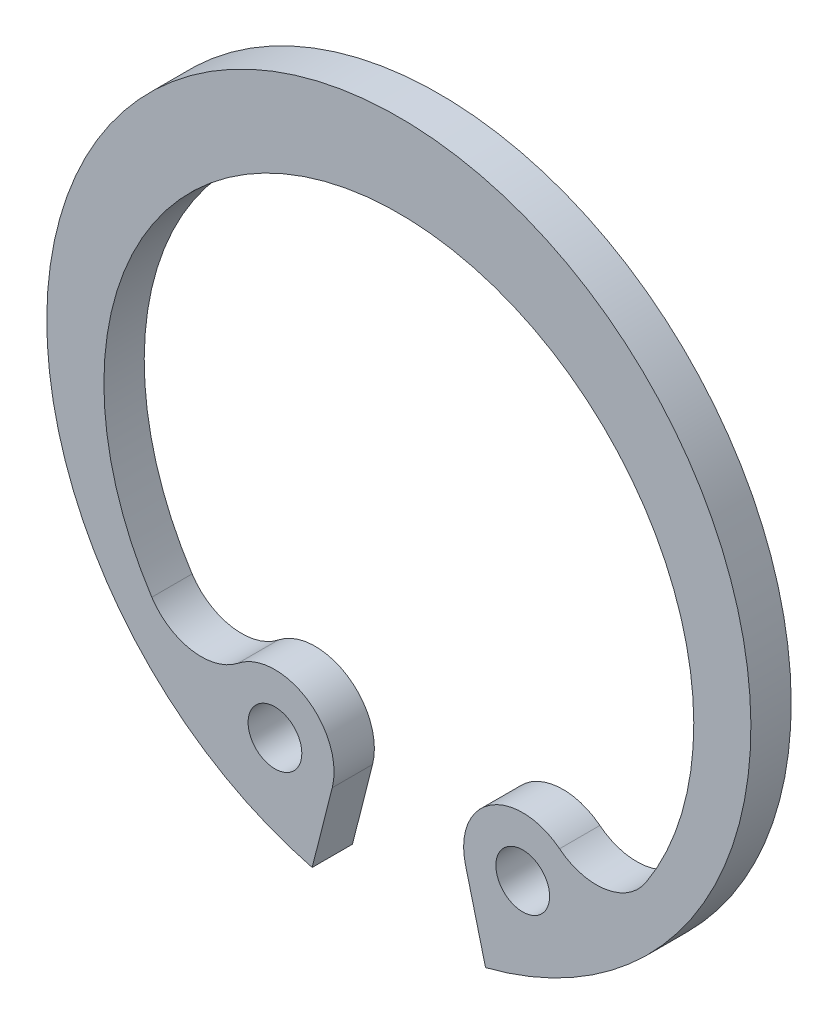
ISO-10303-21;
HEADER;
FILE_DESCRIPTION(('STEP AP214'),'2;1');
FILE_NAME('part.step','',(''),(''),'','','');
FILE_SCHEMA(('AUTOMOTIVE_DESIGN { 1 0 10303 214 1 1 1 1 }'));
ENDSEC;
DATA;
#1=APPLICATION_CONTEXT('core data for automotive mechanical design processes');
#2=APPLICATION_PROTOCOL_DEFINITION('international standard','automotive_design',2000,#1);
#3=PRODUCT_CONTEXT('',#1,'mechanical');
#4=PRODUCT('Part','Part','',(#3));
#5=PRODUCT_RELATED_PRODUCT_CATEGORY('part','',(#4));
#6=PRODUCT_DEFINITION_FORMATION('','',#4);
#7=PRODUCT_DEFINITION_CONTEXT('part definition',#1,'design');
#8=PRODUCT_DEFINITION('design','',#6,#7);
#9=PRODUCT_DEFINITION_SHAPE('','',#8);
#10=(LENGTH_UNIT() NAMED_UNIT(*) SI_UNIT(.MILLI.,.METRE.));
#11=(NAMED_UNIT(*) PLANE_ANGLE_UNIT() SI_UNIT($,.RADIAN.));
#12=(NAMED_UNIT(*) SI_UNIT($,.STERADIAN.) SOLID_ANGLE_UNIT());
#13=UNCERTAINTY_MEASURE_WITH_UNIT(LENGTH_MEASURE(1.E-05),#10,'distance_accuracy_value','');
#14=(GEOMETRIC_REPRESENTATION_CONTEXT(3) GLOBAL_UNCERTAINTY_ASSIGNED_CONTEXT((#13)) GLOBAL_UNIT_ASSIGNED_CONTEXT((#10,
#11,#12)) REPRESENTATION_CONTEXT('',''));
#15=CARTESIAN_POINT('',(0.,0.,0.));
#16=DIRECTION('',(0.,0.,1.));
#17=DIRECTION('',(1.,0.,0.));
#18=AXIS2_PLACEMENT_3D('',#15,#16,#17);
#19=CARTESIAN_POINT('',(0.,0.,-1.5));
#20=DIRECTION('',(0.,0.,1.));
#21=DIRECTION('',(1.,0.,0.));
#22=AXIS2_PLACEMENT_3D('',#19,#20,#21);
#23=CYLINDRICAL_SURFACE('',#22,13.1);
#24=CARTESIAN_POINT('',(0.,0.,0.));
#25=DIRECTION('',(0.,0.,1.));
#26=DIRECTION('',(1.,0.,0.));
#27=AXIS2_PLACEMENT_3D('',#24,#25,#26);
#28=CIRCLE('',#27,13.1);
#29=CARTESIAN_POINT('',(3.22587684287334,-12.6966026398645,0.));
#30=VERTEX_POINT('',#29);
#31=CARTESIAN_POINT('',(-3.22587684287334,-12.6966026398645,0.));
#32=VERTEX_POINT('',#31);
#33=EDGE_CURVE('E129',#30,#32,#28,.T.);
#34=ORIENTED_EDGE('',*,*,#33,.F.);
#35=DIRECTION('',(0.,0.,1.));
#36=VECTOR('',#35,1.);
#37=CARTESIAN_POINT('',(3.22587684287334,-12.6966026398645,-1.5));
#38=LINE('',#37,#36);
#39=CARTESIAN_POINT('',(3.22587684287334,-12.6966026398645,-1.5));
#40=VERTEX_POINT('',#39);
#41=EDGE_CURVE('E11',#40,#30,#38,.T.);
#42=ORIENTED_EDGE('',*,*,#41,.F.);
#43=CARTESIAN_POINT('',(0.,0.,-1.5));
#44=DIRECTION('',(0.,0.,1.));
#45=DIRECTION('',(1.,0.,0.));
#46=AXIS2_PLACEMENT_3D('',#43,#44,#45);
#47=CIRCLE('',#46,13.1);
#48=CARTESIAN_POINT('',(-3.22587684287334,-12.6966026398645,-1.5));
#49=VERTEX_POINT('',#48);
#50=EDGE_CURVE('E150',#40,#49,#47,.T.);
#51=ORIENTED_EDGE('',*,*,#50,.T.);
#52=DIRECTION('',(0.,0.,1.));
#53=VECTOR('',#52,1.);
#54=CARTESIAN_POINT('',(-3.22587684287334,-12.6966026398645,-1.5));
#55=LINE('',#54,#53);
#56=EDGE_CURVE('E35',#49,#32,#55,.T.);
#57=ORIENTED_EDGE('',*,*,#56,.T.);
#58=EDGE_LOOP('',(#34,#42,#51,#57));
#59=FACE_BOUND('',#58,.T.);
#60=ADVANCED_FACE('F32',(#59),#23,.T.);
#61=CARTESIAN_POINT('',(3.22587684287334,-12.6966026398645,-1.5));
#62=DIRECTION('',(-0.969206308386601,-0.246250140677354,0.));
#63=DIRECTION('',(0.246250140677354,-0.969206308386601,0.));
#64=AXIS2_PLACEMENT_3D('',#61,#62,#63);
#65=PLANE('',#64);
#66=DIRECTION('',(0.246250140677354,-0.969206308386601,0.));
#67=VECTOR('',#66,1.);
#68=CARTESIAN_POINT('',(3.22587684287334,-12.6966026398645,0.));
#69=LINE('',#68,#67);
#70=CARTESIAN_POINT('',(2.47784424310552,-9.75245035398329,0.));
#71=VERTEX_POINT('',#70);
#72=EDGE_CURVE('E148',#71,#30,#69,.T.);
#73=ORIENTED_EDGE('',*,*,#72,.F.);
#74=DIRECTION('',(0.,0.,1.));
#75=VECTOR('',#74,1.);
#76=CARTESIAN_POINT('',(2.47784424310552,-9.75245035398329,-1.5));
#77=LINE('',#76,#75);
#78=CARTESIAN_POINT('',(2.47784424310552,-9.75245035398329,-1.5));
#79=VERTEX_POINT('',#78);
#80=EDGE_CURVE('E41',#79,#71,#77,.T.);
#81=ORIENTED_EDGE('',*,*,#80,.F.);
#82=DIRECTION('',(0.246250140677354,-0.969206308386601,0.));
#83=VECTOR('',#82,1.);
#84=CARTESIAN_POINT('',(3.22587684287334,-12.6966026398645,-1.5));
#85=LINE('',#84,#83);
#86=EDGE_CURVE('E119',#79,#40,#85,.T.);
#87=ORIENTED_EDGE('',*,*,#86,.T.);
#88=ORIENTED_EDGE('',*,*,#41,.T.);
#89=EDGE_LOOP('',(#73,#81,#87,#88));
#90=FACE_BOUND('',#89,.T.);
#91=ADVANCED_FACE('F162',(#90),#65,.T.);
#92=CARTESIAN_POINT('',(4.61009812155604,-9.21070004449311,-1.5));
#93=DIRECTION('',(0.,0.,1.));
#94=DIRECTION('',(1.,0.,0.));
#95=AXIS2_PLACEMENT_3D('',#92,#93,#94);
#96=CYLINDRICAL_SURFACE('',#95,2.2);
#97=CARTESIAN_POINT('',(4.61009812155604,-9.21070004449311,0.));
#98=DIRECTION('',(0.,0.,1.));
#99=DIRECTION('',(1.,0.,0.));
#100=AXIS2_PLACEMENT_3D('',#97,#98,#99);
#101=CIRCLE('',#100,2.2);
#102=CARTESIAN_POINT('',(5.98015895464321,-7.48938272521683,0.));
#103=VERTEX_POINT('',#102);
#104=EDGE_CURVE('E106',#103,#71,#101,.T.);
#105=ORIENTED_EDGE('',*,*,#104,.F.);
#106=DIRECTION('',(0.,0.,1.));
#107=VECTOR('',#106,1.);
#108=CARTESIAN_POINT('',(5.98015895464321,-7.48938272521683,-1.5));
#109=LINE('',#108,#107);
#110=CARTESIAN_POINT('',(5.98015895464321,-7.48938272521683,-1.5));
#111=VERTEX_POINT('',#110);
#112=EDGE_CURVE('E101',#111,#103,#109,.T.);
#113=ORIENTED_EDGE('',*,*,#112,.F.);
#114=CARTESIAN_POINT('',(4.61009812155604,-9.21070004449311,-1.5));
#115=DIRECTION('',(0.,0.,1.));
#116=DIRECTION('',(1.,0.,0.));
#117=AXIS2_PLACEMENT_3D('',#114,#115,#116);
#118=CIRCLE('',#117,2.2);
#119=EDGE_CURVE('E104',#111,#79,#118,.T.);
#120=ORIENTED_EDGE('',*,*,#119,.T.);
#121=ORIENTED_EDGE('',*,*,#80,.T.);
#122=EDGE_LOOP('',(#105,#113,#120,#121));
#123=FACE_BOUND('',#122,.T.);
#124=ADVANCED_FACE('F103',(#123),#96,.T.);
#125=CARTESIAN_POINT('',(7.35021978773038,-5.76806540594054,-1.5));
#126=DIRECTION('',(0.,0.,1.));
#127=DIRECTION('',(1.,0.,0.));
#128=AXIS2_PLACEMENT_3D('',#125,#126,#127);
#129=CYLINDRICAL_SURFACE('',#128,2.2);
#130=CARTESIAN_POINT('',(7.35021978773038,-5.76806540594054,0.));
#131=DIRECTION('',(0.,0.,-1.));
#132=DIRECTION('',(1.,0.,0.));
#133=AXIS2_PLACEMENT_3D('',#130,#131,#132);
#134=CIRCLE('',#133,2.2);
#135=CARTESIAN_POINT('',(9.19302090847679,-6.96976588000875,0.));
#136=VERTEX_POINT('',#135);
#137=EDGE_CURVE('E145',#136,#103,#134,.T.);
#138=ORIENTED_EDGE('',*,*,#137,.F.);
#139=DIRECTION('',(0.,0.,1.));
#140=VECTOR('',#139,1.);
#141=CARTESIAN_POINT('',(9.19302090847679,-6.96976588000875,-1.5));
#142=LINE('',#141,#140);
#143=CARTESIAN_POINT('',(9.19302090847679,-6.96976588000875,-1.5));
#144=VERTEX_POINT('',#143);
#145=EDGE_CURVE('E111',#144,#136,#142,.T.);
#146=ORIENTED_EDGE('',*,*,#145,.F.);
#147=CARTESIAN_POINT('',(7.35021978773038,-5.76806540594054,-1.5));
#148=DIRECTION('',(0.,0.,-1.));
#149=DIRECTION('',(1.,0.,0.));
#150=AXIS2_PLACEMENT_3D('',#147,#148,#149);
#151=CIRCLE('',#150,2.2);
#152=EDGE_CURVE('E117',#144,#111,#151,.T.);
#153=ORIENTED_EDGE('',*,*,#152,.T.);
#154=ORIENTED_EDGE('',*,*,#112,.T.);
#155=EDGE_LOOP('',(#138,#146,#153,#154));
#156=FACE_BOUND('',#155,.T.);
#157=ADVANCED_FACE('F121',(#156),#129,.F.);
#158=CARTESIAN_POINT('',(0.,-0.974947741760141,-1.5));
#159=DIRECTION('',(0.,0.,1.));
#160=DIRECTION('',(1.,0.,0.));
#161=AXIS2_PLACEMENT_3D('',#158,#159,#160);
#162=CYLINDRICAL_SURFACE('',#161,10.9749477417601);
#163=CARTESIAN_POINT('',(0.,-0.974947741760141,0.));
#164=DIRECTION('',(0.,0.,-1.));
#165=DIRECTION('',(1.,0.,0.));
#166=AXIS2_PLACEMENT_3D('',#163,#164,#165);
#167=CIRCLE('',#166,10.9749477417601);
#168=CARTESIAN_POINT('',(-9.19302090847681,-6.96976588000875,0.));
#169=VERTEX_POINT('',#168);
#170=EDGE_CURVE('E142',#169,#136,#167,.T.);
#171=ORIENTED_EDGE('',*,*,#170,.F.);
#172=DIRECTION('',(0.,0.,1.));
#173=VECTOR('',#172,1.);
#174=CARTESIAN_POINT('',(-9.19302090847681,-6.96976588000875,-1.5));
#175=LINE('',#174,#173);
#176=CARTESIAN_POINT('',(-9.19302090847681,-6.96976588000875,-1.5));
#177=VERTEX_POINT('',#176);
#178=EDGE_CURVE('E154',#177,#169,#175,.T.);
#179=ORIENTED_EDGE('',*,*,#178,.F.);
#180=CARTESIAN_POINT('',(0.,-0.974947741760141,-1.5));
#181=DIRECTION('',(0.,0.,-1.));
#182=DIRECTION('',(1.,0.,0.));
#183=AXIS2_PLACEMENT_3D('',#180,#181,#182);
#184=CIRCLE('',#183,10.9749477417601);
#185=EDGE_CURVE('E122',#177,#144,#184,.T.);
#186=ORIENTED_EDGE('',*,*,#185,.T.);
#187=ORIENTED_EDGE('',*,*,#145,.T.);
#188=EDGE_LOOP('',(#171,#179,#186,#187));
#189=FACE_BOUND('',#188,.T.);
#190=ADVANCED_FACE('F175',(#189),#162,.F.);
#191=CARTESIAN_POINT('',(-7.35021978773039,-5.76806540594052,-1.5));
#192=DIRECTION('',(0.,0.,1.));
#193=DIRECTION('',(1.,0.,0.));
#194=AXIS2_PLACEMENT_3D('',#191,#192,#193);
#195=CYLINDRICAL_SURFACE('',#194,2.20000000000001);
#196=CARTESIAN_POINT('',(-7.35021978773039,-5.76806540594052,0.));
#197=DIRECTION('',(0.,0.,-1.));
#198=DIRECTION('',(1.,0.,0.));
#199=AXIS2_PLACEMENT_3D('',#196,#197,#198);
#200=CIRCLE('',#199,2.20000000000001);
#201=CARTESIAN_POINT('',(-5.98015895464321,-7.48938272521683,0.));
#202=VERTEX_POINT('',#201);
#203=EDGE_CURVE('E139',#202,#169,#200,.T.);
#204=ORIENTED_EDGE('',*,*,#203,.F.);
#205=DIRECTION('',(0.,0.,1.));
#206=VECTOR('',#205,1.);
#207=CARTESIAN_POINT('',(-5.98015895464321,-7.48938272521683,-1.5));
#208=LINE('',#207,#206);
#209=CARTESIAN_POINT('',(-5.98015895464321,-7.48938272521683,-1.5));
#210=VERTEX_POINT('',#209);
#211=EDGE_CURVE('E156',#210,#202,#208,.T.);
#212=ORIENTED_EDGE('',*,*,#211,.F.);
#213=CARTESIAN_POINT('',(-7.35021978773039,-5.76806540594052,-1.5));
#214=DIRECTION('',(0.,0.,-1.));
#215=DIRECTION('',(1.,0.,0.));
#216=AXIS2_PLACEMENT_3D('',#213,#214,#215);
#217=CIRCLE('',#216,2.20000000000001);
#218=EDGE_CURVE('E124',#210,#177,#217,.T.);
#219=ORIENTED_EDGE('',*,*,#218,.T.);
#220=ORIENTED_EDGE('',*,*,#178,.T.);
#221=EDGE_LOOP('',(#204,#212,#219,#220));
#222=FACE_BOUND('',#221,.T.);
#223=ADVANCED_FACE('F178',(#222),#195,.F.);
#224=CARTESIAN_POINT('',(-4.61009812155604,-9.21070004449311,-1.5));
#225=DIRECTION('',(0.,0.,1.));
#226=DIRECTION('',(1.,0.,0.));
#227=AXIS2_PLACEMENT_3D('',#224,#225,#226);
#228=CYLINDRICAL_SURFACE('',#227,2.2);
#229=CARTESIAN_POINT('',(-4.61009812155604,-9.21070004449311,0.));
#230=DIRECTION('',(0.,0.,1.));
#231=DIRECTION('',(1.,0.,0.));
#232=AXIS2_PLACEMENT_3D('',#229,#230,#231);
#233=CIRCLE('',#232,2.2);
#234=CARTESIAN_POINT('',(-2.47784424310552,-9.75245035398329,0.));
#235=VERTEX_POINT('',#234);
#236=EDGE_CURVE('E136',#235,#202,#233,.T.);
#237=ORIENTED_EDGE('',*,*,#236,.F.);
#238=DIRECTION('',(0.,0.,1.));
#239=VECTOR('',#238,1.);
#240=CARTESIAN_POINT('',(-2.47784424310552,-9.75245035398329,-1.5));
#241=LINE('',#240,#239);
#242=CARTESIAN_POINT('',(-2.47784424310552,-9.75245035398329,-1.5));
#243=VERTEX_POINT('',#242);
#244=EDGE_CURVE('E157',#243,#235,#241,.T.);
#245=ORIENTED_EDGE('',*,*,#244,.F.);
#246=CARTESIAN_POINT('',(-4.61009812155604,-9.21070004449311,-1.5));
#247=DIRECTION('',(0.,0.,1.));
#248=DIRECTION('',(1.,0.,0.));
#249=AXIS2_PLACEMENT_3D('',#246,#247,#248);
#250=CIRCLE('',#249,2.2);
#251=EDGE_CURVE('E224',#243,#210,#250,.T.);
#252=ORIENTED_EDGE('',*,*,#251,.T.);
#253=ORIENTED_EDGE('',*,*,#211,.T.);
#254=EDGE_LOOP('',(#237,#245,#252,#253));
#255=FACE_BOUND('',#254,.T.);
#256=ADVANCED_FACE('F182',(#255),#228,.T.);
#257=CARTESIAN_POINT('',(-3.22587684287334,-12.6966026398645,-1.5));
#258=DIRECTION('',(0.969206308386601,-0.246250140677354,0.));
#259=DIRECTION('',(0.246250140677354,0.969206308386601,0.));
#260=AXIS2_PLACEMENT_3D('',#257,#258,#259);
#261=PLANE('',#260);
#262=DIRECTION('',(0.246250140677354,0.969206308386601,0.));
#263=VECTOR('',#262,1.);
#264=CARTESIAN_POINT('',(-3.22587684287334,-12.6966026398645,0.));
#265=LINE('',#264,#263);
#266=EDGE_CURVE('E132',#32,#235,#265,.T.);
#267=ORIENTED_EDGE('',*,*,#266,.F.);
#268=ORIENTED_EDGE('',*,*,#56,.F.);
#269=DIRECTION('',(0.246250140677354,0.969206308386601,0.));
#270=VECTOR('',#269,1.);
#271=CARTESIAN_POINT('',(-3.22587684287334,-12.6966026398645,-1.5));
#272=LINE('',#271,#270);
#273=EDGE_CURVE('E222',#49,#243,#272,.T.);
#274=ORIENTED_EDGE('',*,*,#273,.T.);
#275=ORIENTED_EDGE('',*,*,#244,.T.);
#276=EDGE_LOOP('',(#267,#268,#274,#275));
#277=FACE_BOUND('',#276,.T.);
#278=ADVANCED_FACE('F159',(#277),#261,.T.);
#279=CARTESIAN_POINT('',(0.,0.,-1.5));
#280=DIRECTION('',(0.,0.,1.));
#281=DIRECTION('',(1.,0.,0.));
#282=AXIS2_PLACEMENT_3D('',#279,#280,#281);
#283=PLANE('',#282);
#284=CARTESIAN_POINT('',(-4.61009812155605,-9.21070004449311,-1.5));
#285=DIRECTION('',(0.,0.,1.));
#286=DIRECTION('',(1.,0.,0.));
#287=AXIS2_PLACEMENT_3D('',#284,#285,#286);
#288=CIRCLE('',#287,0.999999999999982);
#289=CARTESIAN_POINT('',(-3.61009812155606,-9.21070004449311,-1.5));
#290=VERTEX_POINT('',#289);
#291=EDGE_CURVE('E209',#290,#290,#288,.T.);
#292=ORIENTED_EDGE('',*,*,#291,.T.);
#293=EDGE_LOOP('',(#292));
#294=FACE_BOUND('',#293,.T.);
#295=CARTESIAN_POINT('',(4.61009812155604,-9.21070004449311,-1.5));
#296=DIRECTION('',(0.,0.,1.));
#297=DIRECTION('',(1.,0.,0.));
#298=AXIS2_PLACEMENT_3D('',#295,#296,#297);
#299=CIRCLE('',#298,1.);
#300=CARTESIAN_POINT('',(5.61009812155604,-9.21070004449311,-1.5));
#301=VERTEX_POINT('',#300);
#302=EDGE_CURVE('E133',#301,#301,#299,.T.);
#303=ORIENTED_EDGE('',*,*,#302,.T.);
#304=EDGE_LOOP('',(#303));
#305=FACE_BOUND('',#304,.T.);
#306=ORIENTED_EDGE('',*,*,#50,.F.);
#307=ORIENTED_EDGE('',*,*,#86,.F.);
#308=ORIENTED_EDGE('',*,*,#119,.F.);
#309=ORIENTED_EDGE('',*,*,#152,.F.);
#310=ORIENTED_EDGE('',*,*,#185,.F.);
#311=ORIENTED_EDGE('',*,*,#218,.F.);
#312=ORIENTED_EDGE('',*,*,#251,.F.);
#313=ORIENTED_EDGE('',*,*,#273,.F.);
#314=EDGE_LOOP('',(#306,#307,#308,#309,#310,#311,#312,#313));
#315=FACE_BOUND('',#314,.T.);
#316=ADVANCED_FACE('F115',(#294,#305,#315),#283,.F.);
#317=CARTESIAN_POINT('',(0.,0.,0.));
#318=DIRECTION('',(0.,0.,1.));
#319=DIRECTION('',(1.,0.,0.));
#320=AXIS2_PLACEMENT_3D('',#317,#318,#319);
#321=PLANE('',#320);
#322=CARTESIAN_POINT('',(-4.61009812155605,-9.21070004449311,0.));
#323=DIRECTION('',(0.,0.,1.));
#324=DIRECTION('',(1.,0.,0.));
#325=AXIS2_PLACEMENT_3D('',#322,#323,#324);
#326=CIRCLE('',#325,0.999999999999982);
#327=CARTESIAN_POINT('',(-3.61009812155606,-9.21070004449311,0.));
#328=VERTEX_POINT('',#327);
#329=EDGE_CURVE('E212',#328,#328,#326,.T.);
#330=ORIENTED_EDGE('',*,*,#329,.F.);
#331=EDGE_LOOP('',(#330));
#332=FACE_BOUND('',#331,.T.);
#333=CARTESIAN_POINT('',(4.61009812155604,-9.21070004449311,0.));
#334=DIRECTION('',(0.,0.,1.));
#335=DIRECTION('',(1.,0.,0.));
#336=AXIS2_PLACEMENT_3D('',#333,#334,#335);
#337=CIRCLE('',#336,1.);
#338=CARTESIAN_POINT('',(5.61009812155604,-9.21070004449311,0.));
#339=VERTEX_POINT('',#338);
#340=EDGE_CURVE('E214',#339,#339,#337,.T.);
#341=ORIENTED_EDGE('',*,*,#340,.F.);
#342=EDGE_LOOP('',(#341));
#343=FACE_BOUND('',#342,.T.);
#344=ORIENTED_EDGE('',*,*,#33,.T.);
#345=ORIENTED_EDGE('',*,*,#266,.T.);
#346=ORIENTED_EDGE('',*,*,#236,.T.);
#347=ORIENTED_EDGE('',*,*,#203,.T.);
#348=ORIENTED_EDGE('',*,*,#170,.T.);
#349=ORIENTED_EDGE('',*,*,#137,.T.);
#350=ORIENTED_EDGE('',*,*,#104,.T.);
#351=ORIENTED_EDGE('',*,*,#72,.T.);
#352=EDGE_LOOP('',(#344,#345,#346,#347,#348,#349,#350,#351));
#353=FACE_BOUND('',#352,.T.);
#354=ADVANCED_FACE('F161',(#332,#343,#353),#321,.T.);
#355=CARTESIAN_POINT('',(4.61009812155604,-9.21070004449311,-1.5));
#356=DIRECTION('',(0.,0.,1.));
#357=DIRECTION('',(1.,0.,0.));
#358=AXIS2_PLACEMENT_3D('',#355,#356,#357);
#359=CYLINDRICAL_SURFACE('',#358,1.);
#360=ORIENTED_EDGE('',*,*,#302,.F.);
#361=EDGE_LOOP('',(#360));
#362=FACE_BOUND('',#361,.T.);
#363=ORIENTED_EDGE('',*,*,#340,.T.);
#364=EDGE_LOOP('',(#363));
#365=FACE_BOUND('',#364,.T.);
#366=ADVANCED_FACE('F194',(#362,#365),#359,.F.);
#367=CARTESIAN_POINT('',(-4.61009812155605,-9.21070004449311,-1.5));
#368=DIRECTION('',(0.,0.,1.));
#369=DIRECTION('',(1.,0.,0.));
#370=AXIS2_PLACEMENT_3D('',#367,#368,#369);
#371=CYLINDRICAL_SURFACE('',#370,0.999999999999982);
#372=ORIENTED_EDGE('',*,*,#291,.F.);
#373=EDGE_LOOP('',(#372));
#374=FACE_BOUND('',#373,.T.);
#375=ORIENTED_EDGE('',*,*,#329,.T.);
#376=EDGE_LOOP('',(#375));
#377=FACE_BOUND('',#376,.T.);
#378=ADVANCED_FACE('F201',(#374,#377),#371,.F.);
#379=CLOSED_SHELL('',(#60,#91,#124,#157,#190,#223,#256,#278,#316,#354,#366,#378));
#380=MANIFOLD_SOLID_BREP('B2',#379);
#381=ADVANCED_BREP_SHAPE_REPRESENTATION('',(#18,#380),#14);
#382=SHAPE_DEFINITION_REPRESENTATION(#9,#381);
ENDSEC;
END-ISO-10303-21;
